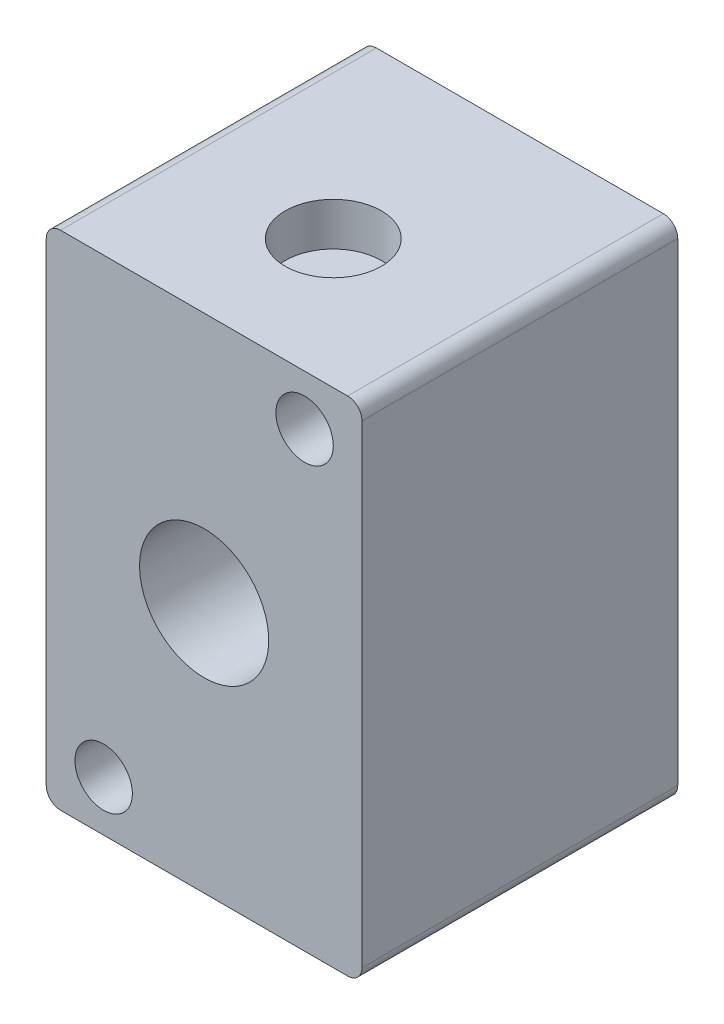
ISO-10303-21;
HEADER;
FILE_DESCRIPTION(('STEP AP214'),'2;1');
FILE_NAME('part.step','',(''),(''),'','','');
FILE_SCHEMA(('AUTOMOTIVE_DESIGN { 1 0 10303 214 1 1 1 1 }'));
ENDSEC;
DATA;
#1=APPLICATION_CONTEXT('core data for automotive mechanical design processes');
#2=APPLICATION_PROTOCOL_DEFINITION('international standard','automotive_design',2000,#1);
#3=PRODUCT_CONTEXT('',#1,'mechanical');
#4=PRODUCT('Part','Part','',(#3));
#5=PRODUCT_RELATED_PRODUCT_CATEGORY('part','',(#4));
#6=PRODUCT_DEFINITION_FORMATION('','',#4);
#7=PRODUCT_DEFINITION_CONTEXT('part definition',#1,'design');
#8=PRODUCT_DEFINITION('design','',#6,#7);
#9=PRODUCT_DEFINITION_SHAPE('','',#8);
#10=(LENGTH_UNIT() NAMED_UNIT(*) SI_UNIT(.MILLI.,.METRE.));
#11=(NAMED_UNIT(*) PLANE_ANGLE_UNIT() SI_UNIT($,.RADIAN.));
#12=(NAMED_UNIT(*) SI_UNIT($,.STERADIAN.) SOLID_ANGLE_UNIT());
#13=UNCERTAINTY_MEASURE_WITH_UNIT(LENGTH_MEASURE(1.E-05),#10,'distance_accuracy_value','');
#14=(GEOMETRIC_REPRESENTATION_CONTEXT(3) GLOBAL_UNCERTAINTY_ASSIGNED_CONTEXT((#13)) GLOBAL_UNIT_ASSIGNED_CONTEXT((#10,
#11,#12)) REPRESENTATION_CONTEXT('',''));
#15=CARTESIAN_POINT('',(0.,0.,0.));
#16=DIRECTION('',(0.,0.,1.));
#17=DIRECTION('',(1.,0.,0.));
#18=AXIS2_PLACEMENT_3D('',#15,#16,#17);
#19=CARTESIAN_POINT('',(-5.86092041698449,15.4504195270786,-34.));
#20=DIRECTION('',(0.,1.,0.));
#21=DIRECTION('',(0.,0.,1.));
#22=AXIS2_PLACEMENT_3D('',#19,#20,#21);
#23=PLANE('',#22);
#24=CARTESIAN_POINT('',(-5.86092041698449,15.4504195270786,-34.));
#25=DIRECTION('',(0.,-1.,0.));
#26=DIRECTION('',(0.,0.,-1.));
#27=AXIS2_PLACEMENT_3D('',#24,#25,#26);
#28=CIRCLE('',#27,3.35);
#29=CARTESIAN_POINT('',(-5.86092041698449,15.4504195270786,-37.35));
#30=VERTEX_POINT('',#29);
#31=EDGE_CURVE('E157',#30,#30,#28,.F.);
#32=ORIENTED_EDGE('',*,*,#31,.T.);
#33=EDGE_LOOP('',(#32));
#34=FACE_BOUND('',#33,.T.);
#35=ADVANCED_FACE('F17',(#34),#23,.T.);
#36=CARTESIAN_POINT('',(4.13907958301551,17.4504195270786,-47.));
#37=DIRECTION('',(0.,0.,-1.));
#38=DIRECTION('',(-1.,0.,0.));
#39=AXIS2_PLACEMENT_3D('',#36,#37,#38);
#40=CYLINDRICAL_SURFACE('',#39,1.);
#41=CARTESIAN_POINT('',(4.13907958301551,17.4504195270786,-47.));
#42=DIRECTION('',(0.,0.,-1.));
#43=DIRECTION('',(-1.,0.,0.));
#44=AXIS2_PLACEMENT_3D('',#41,#42,#43);
#45=CIRCLE('',#44,1.);
#46=CARTESIAN_POINT('',(5.13907958301551,17.4504195270786,-47.));
#47=VERTEX_POINT('',#46);
#48=CARTESIAN_POINT('',(4.13907958301551,18.4504195270786,-47.));
#49=VERTEX_POINT('',#48);
#50=EDGE_CURVE('E89',#47,#49,#45,.F.);
#51=ORIENTED_EDGE('',*,*,#50,.T.);
#52=DIRECTION('',(0.,0.,1.));
#53=VECTOR('',#52,1.);
#54=CARTESIAN_POINT('',(4.13907958301551,18.4504195270786,-47.));
#55=LINE('',#54,#53);
#56=CARTESIAN_POINT('',(4.13907958301551,18.4504195270786,-25.));
#57=VERTEX_POINT('',#56);
#58=EDGE_CURVE('E87',#57,#49,#55,.F.);
#59=ORIENTED_EDGE('',*,*,#58,.F.);
#60=CARTESIAN_POINT('',(4.13907958301551,17.4504195270786,-25.));
#61=DIRECTION('',(0.,0.,-1.));
#62=DIRECTION('',(-1.,0.,0.));
#63=AXIS2_PLACEMENT_3D('',#60,#61,#62);
#64=CIRCLE('',#63,1.);
#65=CARTESIAN_POINT('',(5.13907958301551,17.4504195270786,-25.));
#66=VERTEX_POINT('',#65);
#67=EDGE_CURVE('E20',#57,#66,#64,.T.);
#68=ORIENTED_EDGE('',*,*,#67,.T.);
#69=DIRECTION('',(0.,0.,1.));
#70=VECTOR('',#69,1.);
#71=CARTESIAN_POINT('',(5.13907958301551,17.4504195270786,-47.));
#72=LINE('',#71,#70);
#73=EDGE_CURVE('E84',#47,#66,#72,.T.);
#74=ORIENTED_EDGE('',*,*,#73,.F.);
#75=EDGE_LOOP('',(#51,#59,#68,#74));
#76=FACE_BOUND('',#75,.T.);
#77=ADVANCED_FACE('F83',(#76),#40,.T.);
#78=CARTESIAN_POINT('',(-5.86092041698449,15.4504195270786,-34.));
#79=DIRECTION('',(0.,-1.,0.));
#80=DIRECTION('',(0.,0.,-1.));
#81=AXIS2_PLACEMENT_3D('',#78,#79,#80);
#82=CYLINDRICAL_SURFACE('',#81,3.35);
#83=CARTESIAN_POINT('',(-5.86092041698449,18.4504195270786,-34.));
#84=DIRECTION('',(0.,-1.,0.));
#85=DIRECTION('',(0.,0.,-1.));
#86=AXIS2_PLACEMENT_3D('',#83,#84,#85);
#87=CIRCLE('',#86,3.35);
#88=CARTESIAN_POINT('',(-5.86092041698449,18.4504195270786,-37.35));
#89=VERTEX_POINT('',#88);
#90=EDGE_CURVE('E118',#89,#89,#87,.T.);
#91=ORIENTED_EDGE('',*,*,#90,.F.);
#92=EDGE_LOOP('',(#91));
#93=FACE_BOUND('',#92,.T.);
#94=ORIENTED_EDGE('',*,*,#31,.F.);
#95=EDGE_LOOP('',(#94));
#96=FACE_BOUND('',#95,.T.);
#97=ADVANCED_FACE('F188',(#93,#96),#82,.F.);
#98=CARTESIAN_POINT('',(4.13907958301551,-15.5495804729214,-47.));
#99=DIRECTION('',(0.,0.,-1.));
#100=DIRECTION('',(-1.,0.,0.));
#101=AXIS2_PLACEMENT_3D('',#98,#99,#100);
#102=CYLINDRICAL_SURFACE('',#101,1.);
#103=CARTESIAN_POINT('',(4.13907958301551,-15.5495804729214,-47.));
#104=DIRECTION('',(0.,0.,-1.));
#105=DIRECTION('',(-1.,0.,0.));
#106=AXIS2_PLACEMENT_3D('',#103,#104,#105);
#107=CIRCLE('',#106,1.);
#108=CARTESIAN_POINT('',(4.13907958301551,-16.5495804729214,-47.));
#109=VERTEX_POINT('',#108);
#110=CARTESIAN_POINT('',(5.13907958301551,-15.5495804729214,-47.));
#111=VERTEX_POINT('',#110);
#112=EDGE_CURVE('E98',#109,#111,#107,.F.);
#113=ORIENTED_EDGE('',*,*,#112,.T.);
#114=DIRECTION('',(0.,0.,1.));
#115=VECTOR('',#114,1.);
#116=CARTESIAN_POINT('',(5.13907958301551,-15.5495804729214,-47.));
#117=LINE('',#116,#115);
#118=CARTESIAN_POINT('',(5.13907958301551,-15.5495804729214,-25.));
#119=VERTEX_POINT('',#118);
#120=EDGE_CURVE('E97',#119,#111,#117,.F.);
#121=ORIENTED_EDGE('',*,*,#120,.F.);
#122=CARTESIAN_POINT('',(4.13907958301551,-15.5495804729214,-25.));
#123=DIRECTION('',(0.,0.,-1.));
#124=DIRECTION('',(-1.,0.,0.));
#125=AXIS2_PLACEMENT_3D('',#122,#123,#124);
#126=CIRCLE('',#125,1.);
#127=CARTESIAN_POINT('',(4.13907958301551,-16.5495804729214,-25.));
#128=VERTEX_POINT('',#127);
#129=EDGE_CURVE('E102',#119,#128,#126,.T.);
#130=ORIENTED_EDGE('',*,*,#129,.T.);
#131=DIRECTION('',(0.,0.,1.));
#132=VECTOR('',#131,1.);
#133=CARTESIAN_POINT('',(4.13907958301551,-16.5495804729214,-47.));
#134=LINE('',#133,#132);
#135=EDGE_CURVE('E109',#109,#128,#134,.T.);
#136=ORIENTED_EDGE('',*,*,#135,.F.);
#137=EDGE_LOOP('',(#113,#121,#130,#136));
#138=FACE_BOUND('',#137,.T.);
#139=ADVANCED_FACE('F186',(#138),#102,.T.);
#140=CARTESIAN_POINT('',(5.13907958301551,18.4504195270786,-47.));
#141=DIRECTION('',(1.,0.,0.));
#142=DIRECTION('',(0.,1.,0.));
#143=AXIS2_PLACEMENT_3D('',#140,#141,#142);
#144=PLANE('',#143);
#145=DIRECTION('',(0.,1.,0.));
#146=VECTOR('',#145,1.);
#147=CARTESIAN_POINT('',(5.13907958301551,0.950419527078566,-25.));
#148=LINE('',#147,#146);
#149=EDGE_CURVE('E94',#66,#119,#148,.F.);
#150=ORIENTED_EDGE('',*,*,#149,.T.);
#151=ORIENTED_EDGE('',*,*,#120,.T.);
#152=DIRECTION('',(0.,1.,0.));
#153=VECTOR('',#152,1.);
#154=CARTESIAN_POINT('',(5.13907958301551,0.950419527078566,-47.));
#155=LINE('',#154,#153);
#156=EDGE_CURVE('E96',#47,#111,#155,.F.);
#157=ORIENTED_EDGE('',*,*,#156,.F.);
#158=ORIENTED_EDGE('',*,*,#73,.T.);
#159=EDGE_LOOP('',(#150,#151,#157,#158));
#160=FACE_BOUND('',#159,.T.);
#161=ADVANCED_FACE('F92',(#160),#144,.T.);
#162=CARTESIAN_POINT('',(-16.8609204169845,18.4504195270786,-47.));
#163=DIRECTION('',(0.,1.,0.));
#164=DIRECTION('',(0.,0.,1.));
#165=AXIS2_PLACEMENT_3D('',#162,#163,#164);
#166=PLANE('',#165);
#167=ORIENTED_EDGE('',*,*,#90,.T.);
#168=EDGE_LOOP('',(#167));
#169=FACE_BOUND('',#168,.T.);
#170=DIRECTION('',(-1.,0.,0.));
#171=VECTOR('',#170,1.);
#172=CARTESIAN_POINT('',(-5.86092041698449,18.4504195270786,-47.));
#173=LINE('',#172,#171);
#174=CARTESIAN_POINT('',(-15.8609204169845,18.4504195270786,-47.));
#175=VERTEX_POINT('',#174);
#176=EDGE_CURVE('E138',#175,#49,#173,.F.);
#177=ORIENTED_EDGE('',*,*,#176,.F.);
#178=DIRECTION('',(0.,0.,-1.));
#179=VECTOR('',#178,1.);
#180=CARTESIAN_POINT('',(-15.8609204169845,18.4504195270786,-47.));
#181=LINE('',#180,#179);
#182=CARTESIAN_POINT('',(-15.8609204169845,18.4504195270786,-25.));
#183=VERTEX_POINT('',#182);
#184=EDGE_CURVE('E119',#183,#175,#181,.T.);
#185=ORIENTED_EDGE('',*,*,#184,.F.);
#186=DIRECTION('',(-1.,0.,0.));
#187=VECTOR('',#186,1.);
#188=CARTESIAN_POINT('',(-5.86092041698449,18.4504195270786,-25.));
#189=LINE('',#188,#187);
#190=EDGE_CURVE('E105',#183,#57,#189,.F.);
#191=ORIENTED_EDGE('',*,*,#190,.T.);
#192=ORIENTED_EDGE('',*,*,#58,.T.);
#193=EDGE_LOOP('',(#177,#185,#191,#192));
#194=FACE_BOUND('',#193,.T.);
#195=ADVANCED_FACE('F162',(#169,#194),#166,.T.);
#196=CARTESIAN_POINT('',(-5.86092041698449,0.950419527078566,-47.));
#197=DIRECTION('',(0.,0.,-1.));
#198=DIRECTION('',(-1.,0.,0.));
#199=AXIS2_PLACEMENT_3D('',#196,#197,#198);
#200=CYLINDRICAL_SURFACE('',#199,4.5);
#201=CARTESIAN_POINT('',(-5.86092041698449,0.950419527078566,-47.));
#202=DIRECTION('',(0.,0.,-1.));
#203=DIRECTION('',(-1.,0.,0.));
#204=AXIS2_PLACEMENT_3D('',#201,#202,#203);
#205=CIRCLE('',#204,4.5);
#206=CARTESIAN_POINT('',(-10.3609204169845,0.950419527078566,-47.));
#207=VERTEX_POINT('',#206);
#208=EDGE_CURVE('E135',#207,#207,#205,.F.);
#209=ORIENTED_EDGE('',*,*,#208,.F.);
#210=EDGE_LOOP('',(#209));
#211=FACE_BOUND('',#210,.T.);
#212=CARTESIAN_POINT('',(-5.86092041698449,0.950419527078566,-25.));
#213=DIRECTION('',(0.,0.,-1.));
#214=DIRECTION('',(-1.,0.,0.));
#215=AXIS2_PLACEMENT_3D('',#212,#213,#214);
#216=CIRCLE('',#215,4.5);
#217=CARTESIAN_POINT('',(-10.3609204169845,0.950419527078566,-25.));
#218=VERTEX_POINT('',#217);
#219=EDGE_CURVE('E107',#218,#218,#216,.F.);
#220=ORIENTED_EDGE('',*,*,#219,.T.);
#221=EDGE_LOOP('',(#220));
#222=FACE_BOUND('',#221,.T.);
#223=ADVANCED_FACE('F224',(#211,#222),#200,.F.);
#224=CARTESIAN_POINT('',(1.13907958301551,14.9504195270786,-25.));
#225=DIRECTION('',(0.,0.,1.));
#226=DIRECTION('',(1.,0.,0.));
#227=AXIS2_PLACEMENT_3D('',#224,#225,#226);
#228=CYLINDRICAL_SURFACE('',#227,2.);
#229=CARTESIAN_POINT('',(1.13907958301551,14.9504195270786,-47.));
#230=DIRECTION('',(0.,0.,1.));
#231=DIRECTION('',(1.,0.,0.));
#232=AXIS2_PLACEMENT_3D('',#229,#230,#231);
#233=CIRCLE('',#232,2.);
#234=CARTESIAN_POINT('',(3.13907958301552,14.9504195270786,-47.));
#235=VERTEX_POINT('',#234);
#236=EDGE_CURVE('E132',#235,#235,#233,.T.);
#237=ORIENTED_EDGE('',*,*,#236,.F.);
#238=EDGE_LOOP('',(#237));
#239=FACE_BOUND('',#238,.T.);
#240=CARTESIAN_POINT('',(1.13907958301551,14.9504195270786,-25.));
#241=DIRECTION('',(0.,0.,1.));
#242=DIRECTION('',(1.,0.,0.));
#243=AXIS2_PLACEMENT_3D('',#240,#241,#242);
#244=CIRCLE('',#243,2.);
#245=CARTESIAN_POINT('',(3.13907958301552,14.9504195270786,-25.));
#246=VERTEX_POINT('',#245);
#247=EDGE_CURVE('E148',#246,#246,#244,.T.);
#248=ORIENTED_EDGE('',*,*,#247,.T.);
#249=EDGE_LOOP('',(#248));
#250=FACE_BOUND('',#249,.T.);
#251=ADVANCED_FACE('F220',(#239,#250),#228,.F.);
#252=CARTESIAN_POINT('',(-12.8609204169845,-13.0495804729214,-25.));
#253=DIRECTION('',(0.,0.,1.));
#254=DIRECTION('',(1.,0.,0.));
#255=AXIS2_PLACEMENT_3D('',#252,#253,#254);
#256=CYLINDRICAL_SURFACE('',#255,2.);
#257=CARTESIAN_POINT('',(-12.8609204169845,-13.0495804729214,-47.));
#258=DIRECTION('',(0.,0.,1.));
#259=DIRECTION('',(1.,0.,0.));
#260=AXIS2_PLACEMENT_3D('',#257,#258,#259);
#261=CIRCLE('',#260,2.);
#262=CARTESIAN_POINT('',(-10.8609204169845,-13.0495804729214,-47.));
#263=VERTEX_POINT('',#262);
#264=EDGE_CURVE('E129',#263,#263,#261,.T.);
#265=ORIENTED_EDGE('',*,*,#264,.F.);
#266=EDGE_LOOP('',(#265));
#267=FACE_BOUND('',#266,.T.);
#268=CARTESIAN_POINT('',(-12.8609204169845,-13.0495804729214,-25.));
#269=DIRECTION('',(0.,0.,1.));
#270=DIRECTION('',(1.,0.,0.));
#271=AXIS2_PLACEMENT_3D('',#268,#269,#270);
#272=CIRCLE('',#271,2.);
#273=CARTESIAN_POINT('',(-10.8609204169845,-13.0495804729214,-25.));
#274=VERTEX_POINT('',#273);
#275=EDGE_CURVE('E145',#274,#274,#272,.T.);
#276=ORIENTED_EDGE('',*,*,#275,.T.);
#277=EDGE_LOOP('',(#276));
#278=FACE_BOUND('',#277,.T.);
#279=ADVANCED_FACE('F217',(#267,#278),#256,.F.);
#280=CARTESIAN_POINT('',(5.13907958301552,-16.5495804729214,-47.));
#281=DIRECTION('',(0.,-1.,0.));
#282=DIRECTION('',(1.,0.,0.));
#283=AXIS2_PLACEMENT_3D('',#280,#281,#282);
#284=PLANE('',#283);
#285=DIRECTION('',(-1.,0.,0.));
#286=VECTOR('',#285,1.);
#287=CARTESIAN_POINT('',(-5.86092041698449,-16.5495804729214,-25.));
#288=LINE('',#287,#286);
#289=CARTESIAN_POINT('',(-15.8609204169845,-16.5495804729214,-25.));
#290=VERTEX_POINT('',#289);
#291=EDGE_CURVE('E104',#128,#290,#288,.T.);
#292=ORIENTED_EDGE('',*,*,#291,.T.);
#293=DIRECTION('',(0.,0.,-1.));
#294=VECTOR('',#293,1.);
#295=CARTESIAN_POINT('',(-15.8609204169845,-16.5495804729214,-47.));
#296=LINE('',#295,#294);
#297=CARTESIAN_POINT('',(-15.8609204169845,-16.5495804729214,-47.));
#298=VERTEX_POINT('',#297);
#299=EDGE_CURVE('E113',#298,#290,#296,.F.);
#300=ORIENTED_EDGE('',*,*,#299,.F.);
#301=DIRECTION('',(-1.,0.,0.));
#302=VECTOR('',#301,1.);
#303=CARTESIAN_POINT('',(-5.86092041698449,-16.5495804729214,-47.));
#304=LINE('',#303,#302);
#305=EDGE_CURVE('E142',#109,#298,#304,.T.);
#306=ORIENTED_EDGE('',*,*,#305,.F.);
#307=ORIENTED_EDGE('',*,*,#135,.T.);
#308=EDGE_LOOP('',(#292,#300,#306,#307));
#309=FACE_BOUND('',#308,.T.);
#310=ADVANCED_FACE('F183',(#309),#284,.T.);
#311=CARTESIAN_POINT('',(-5.86092041698449,0.950419527078566,-25.));
#312=DIRECTION('',(0.,0.,-1.));
#313=DIRECTION('',(-1.,0.,0.));
#314=AXIS2_PLACEMENT_3D('',#311,#312,#313);
#315=PLANE('',#314);
#316=ORIENTED_EDGE('',*,*,#275,.F.);
#317=EDGE_LOOP('',(#316));
#318=FACE_BOUND('',#317,.T.);
#319=ORIENTED_EDGE('',*,*,#247,.F.);
#320=EDGE_LOOP('',(#319));
#321=FACE_BOUND('',#320,.T.);
#322=ORIENTED_EDGE('',*,*,#219,.F.);
#323=EDGE_LOOP('',(#322));
#324=FACE_BOUND('',#323,.T.);
#325=ORIENTED_EDGE('',*,*,#291,.F.);
#326=ORIENTED_EDGE('',*,*,#129,.F.);
#327=ORIENTED_EDGE('',*,*,#149,.F.);
#328=ORIENTED_EDGE('',*,*,#67,.F.);
#329=ORIENTED_EDGE('',*,*,#190,.F.);
#330=CARTESIAN_POINT('',(-15.8609204169845,17.4504195270786,-25.));
#331=DIRECTION('',(0.,0.,-1.));
#332=DIRECTION('',(-1.,0.,0.));
#333=AXIS2_PLACEMENT_3D('',#330,#331,#332);
#334=CIRCLE('',#333,1.);
#335=CARTESIAN_POINT('',(-16.8609204169845,17.4504195270786,-25.));
#336=VERTEX_POINT('',#335);
#337=EDGE_CURVE('E121',#336,#183,#334,.T.);
#338=ORIENTED_EDGE('',*,*,#337,.F.);
#339=DIRECTION('',(0.,1.,0.));
#340=VECTOR('',#339,1.);
#341=CARTESIAN_POINT('',(-16.8609204169845,-16.5495804729214,-25.));
#342=LINE('',#341,#340);
#343=CARTESIAN_POINT('',(-16.8609204169845,-15.5495804729214,-25.));
#344=VERTEX_POINT('',#343);
#345=EDGE_CURVE('E116',#344,#336,#342,.T.);
#346=ORIENTED_EDGE('',*,*,#345,.F.);
#347=CARTESIAN_POINT('',(-15.8609204169845,-15.5495804729214,-25.));
#348=DIRECTION('',(0.,0.,-1.));
#349=DIRECTION('',(-1.,0.,0.));
#350=AXIS2_PLACEMENT_3D('',#347,#348,#349);
#351=CIRCLE('',#350,1.);
#352=EDGE_CURVE('E126',#290,#344,#351,.T.);
#353=ORIENTED_EDGE('',*,*,#352,.F.);
#354=EDGE_LOOP('',(#325,#326,#327,#328,#329,#338,#346,#353));
#355=FACE_BOUND('',#354,.T.);
#356=ADVANCED_FACE('F101',(#318,#321,#324,#355),#315,.F.);
#357=CARTESIAN_POINT('',(-15.8609204169845,17.4504195270786,-47.));
#358=DIRECTION('',(0.,0.,-1.));
#359=DIRECTION('',(-1.,0.,0.));
#360=AXIS2_PLACEMENT_3D('',#357,#358,#359);
#361=CYLINDRICAL_SURFACE('',#360,1.);
#362=CARTESIAN_POINT('',(-15.8609204169845,17.4504195270786,-47.));
#363=DIRECTION('',(0.,0.,-1.));
#364=DIRECTION('',(-1.,0.,0.));
#365=AXIS2_PLACEMENT_3D('',#362,#363,#364);
#366=CIRCLE('',#365,1.);
#367=CARTESIAN_POINT('',(-16.8609204169845,17.4504195270786,-47.));
#368=VERTEX_POINT('',#367);
#369=EDGE_CURVE('E139',#368,#175,#366,.T.);
#370=ORIENTED_EDGE('',*,*,#369,.F.);
#371=DIRECTION('',(0.,0.,1.));
#372=VECTOR('',#371,1.);
#373=CARTESIAN_POINT('',(-16.8609204169845,17.4504195270786,-47.));
#374=LINE('',#373,#372);
#375=EDGE_CURVE('E169',#336,#368,#374,.F.);
#376=ORIENTED_EDGE('',*,*,#375,.F.);
#377=ORIENTED_EDGE('',*,*,#337,.T.);
#378=ORIENTED_EDGE('',*,*,#184,.T.);
#379=EDGE_LOOP('',(#370,#376,#377,#378));
#380=FACE_BOUND('',#379,.T.);
#381=ADVANCED_FACE('F207',(#380),#361,.T.);
#382=CARTESIAN_POINT('',(-5.86092041698449,0.950419527078566,-47.));
#383=DIRECTION('',(0.,0.,-1.));
#384=DIRECTION('',(-1.,0.,0.));
#385=AXIS2_PLACEMENT_3D('',#382,#383,#384);
#386=PLANE('',#385);
#387=ORIENTED_EDGE('',*,*,#264,.T.);
#388=EDGE_LOOP('',(#387));
#389=FACE_BOUND('',#388,.T.);
#390=ORIENTED_EDGE('',*,*,#236,.T.);
#391=EDGE_LOOP('',(#390));
#392=FACE_BOUND('',#391,.T.);
#393=ORIENTED_EDGE('',*,*,#208,.T.);
#394=EDGE_LOOP('',(#393));
#395=FACE_BOUND('',#394,.T.);
#396=ORIENTED_EDGE('',*,*,#176,.T.);
#397=ORIENTED_EDGE('',*,*,#50,.F.);
#398=ORIENTED_EDGE('',*,*,#156,.T.);
#399=ORIENTED_EDGE('',*,*,#112,.F.);
#400=ORIENTED_EDGE('',*,*,#305,.T.);
#401=CARTESIAN_POINT('',(-15.8609204169845,-15.5495804729214,-47.));
#402=DIRECTION('',(0.,0.,-1.));
#403=DIRECTION('',(-1.,0.,0.));
#404=AXIS2_PLACEMENT_3D('',#401,#402,#403);
#405=CIRCLE('',#404,1.);
#406=CARTESIAN_POINT('',(-16.8609204169845,-15.5495804729214,-47.));
#407=VERTEX_POINT('',#406);
#408=EDGE_CURVE('E35',#407,#298,#405,.F.);
#409=ORIENTED_EDGE('',*,*,#408,.F.);
#410=DIRECTION('',(0.,1.,0.));
#411=VECTOR('',#410,1.);
#412=CARTESIAN_POINT('',(-16.8609204169845,-16.5495804729214,-47.));
#413=LINE('',#412,#411);
#414=EDGE_CURVE('E26',#368,#407,#413,.F.);
#415=ORIENTED_EDGE('',*,*,#414,.F.);
#416=ORIENTED_EDGE('',*,*,#369,.T.);
#417=EDGE_LOOP('',(#396,#397,#398,#399,#400,#409,#415,#416));
#418=FACE_BOUND('',#417,.T.);
#419=ADVANCED_FACE('F164',(#389,#392,#395,#418),#386,.T.);
#420=CARTESIAN_POINT('',(-15.8609204169845,-15.5495804729214,-47.));
#421=DIRECTION('',(0.,0.,-1.));
#422=DIRECTION('',(-1.,0.,0.));
#423=AXIS2_PLACEMENT_3D('',#420,#421,#422);
#424=CYLINDRICAL_SURFACE('',#423,1.);
#425=ORIENTED_EDGE('',*,*,#408,.T.);
#426=ORIENTED_EDGE('',*,*,#299,.T.);
#427=ORIENTED_EDGE('',*,*,#352,.T.);
#428=DIRECTION('',(0.,0.,1.));
#429=VECTOR('',#428,1.);
#430=CARTESIAN_POINT('',(-16.8609204169845,-15.5495804729214,-47.));
#431=LINE('',#430,#429);
#432=EDGE_CURVE('E10',#407,#344,#431,.T.);
#433=ORIENTED_EDGE('',*,*,#432,.F.);
#434=EDGE_LOOP('',(#425,#426,#427,#433));
#435=FACE_BOUND('',#434,.T.);
#436=ADVANCED_FACE('F179',(#435),#424,.T.);
#437=CARTESIAN_POINT('',(-16.8609204169845,-16.5495804729214,-47.));
#438=DIRECTION('',(-1.,0.,0.));
#439=DIRECTION('',(0.,0.,1.));
#440=AXIS2_PLACEMENT_3D('',#437,#438,#439);
#441=PLANE('',#440);
#442=ORIENTED_EDGE('',*,*,#414,.T.);
#443=ORIENTED_EDGE('',*,*,#432,.T.);
#444=ORIENTED_EDGE('',*,*,#345,.T.);
#445=ORIENTED_EDGE('',*,*,#375,.T.);
#446=EDGE_LOOP('',(#442,#443,#444,#445));
#447=FACE_BOUND('',#446,.T.);
#448=ADVANCED_FACE('F175',(#447),#441,.T.);
#449=CLOSED_SHELL('',(#35,#77,#97,#139,#161,#195,#223,#251,#279,#310,#356,#381,#419,#436,#448));
#450=MANIFOLD_SOLID_BREP('B1',#449);
#451=ADVANCED_BREP_SHAPE_REPRESENTATION('',(#18,#450),#14);
#452=SHAPE_DEFINITION_REPRESENTATION(#9,#451);
ENDSEC;
END-ISO-10303-21;
